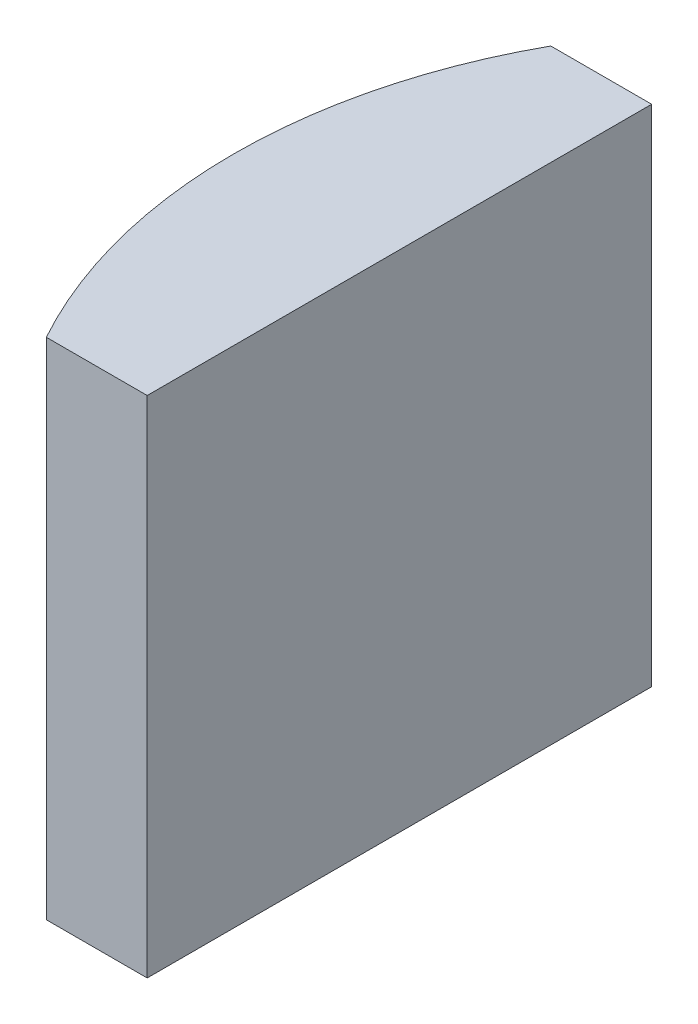
ISO-10303-21;
HEADER;
FILE_DESCRIPTION(('STEP AP214'),'2;1');
FILE_NAME('part.step','',(''),(''),'','','');
FILE_SCHEMA(('AUTOMOTIVE_DESIGN { 1 0 10303 214 1 1 1 1 }'));
ENDSEC;
DATA;
#1=APPLICATION_CONTEXT('core data for automotive mechanical design processes');
#2=APPLICATION_PROTOCOL_DEFINITION('international standard','automotive_design',2000,#1);
#3=PRODUCT_CONTEXT('',#1,'mechanical');
#4=PRODUCT('Part','Part','',(#3));
#5=PRODUCT_RELATED_PRODUCT_CATEGORY('part','',(#4));
#6=PRODUCT_DEFINITION_FORMATION('','',#4);
#7=PRODUCT_DEFINITION_CONTEXT('part definition',#1,'design');
#8=PRODUCT_DEFINITION('design','',#6,#7);
#9=PRODUCT_DEFINITION_SHAPE('','',#8);
#10=(LENGTH_UNIT() NAMED_UNIT(*) SI_UNIT(.MILLI.,.METRE.));
#11=(NAMED_UNIT(*) PLANE_ANGLE_UNIT() SI_UNIT($,.RADIAN.));
#12=(NAMED_UNIT(*) SI_UNIT($,.STERADIAN.) SOLID_ANGLE_UNIT());
#13=UNCERTAINTY_MEASURE_WITH_UNIT(LENGTH_MEASURE(1.E-05),#10,'distance_accuracy_value','');
#14=(GEOMETRIC_REPRESENTATION_CONTEXT(3) GLOBAL_UNCERTAINTY_ASSIGNED_CONTEXT((#13)) GLOBAL_UNIT_ASSIGNED_CONTEXT((#10,
#11,#12)) REPRESENTATION_CONTEXT('',''));
#15=CARTESIAN_POINT('',(0.,0.,0.));
#16=DIRECTION('',(0.,0.,1.));
#17=DIRECTION('',(1.,0.,0.));
#18=AXIS2_PLACEMENT_3D('',#15,#16,#17);
#19=CARTESIAN_POINT('',(4.35520433485127,10.,0.));
#20=DIRECTION('',(0.,-1.,0.));
#21=DIRECTION('',(0.,0.,-1.));
#22=AXIS2_PLACEMENT_3D('',#19,#20,#21);
#23=CYLINDRICAL_SURFACE('',#22,10.33);
#24=CARTESIAN_POINT('',(4.35520433485127,0.,0.));
#25=DIRECTION('',(0.,1.,0.));
#26=DIRECTION('',(0.,0.,1.));
#27=AXIS2_PLACEMENT_3D('',#24,#25,#26);
#28=CIRCLE('',#27,10.33);
#29=CARTESIAN_POINT('',(-4.68409320422776,0.,-5.));
#30=VERTEX_POINT('',#29);
#31=CARTESIAN_POINT('',(-4.68409320422775,0.,5.));
#32=VERTEX_POINT('',#31);
#33=EDGE_CURVE('E100',#30,#32,#28,.T.);
#34=ORIENTED_EDGE('',*,*,#33,.T.);
#35=DIRECTION('',(0.,-1.,0.));
#36=VECTOR('',#35,1.);
#37=CARTESIAN_POINT('',(-4.68409320422775,10.,5.));
#38=LINE('',#37,#36);
#39=CARTESIAN_POINT('',(-4.68409320422775,10.,5.));
#40=VERTEX_POINT('',#39);
#41=EDGE_CURVE('E11',#40,#32,#38,.T.);
#42=ORIENTED_EDGE('',*,*,#41,.F.);
#43=CARTESIAN_POINT('',(4.35520433485127,10.,0.));
#44=DIRECTION('',(0.,1.,0.));
#45=DIRECTION('',(0.,0.,1.));
#46=AXIS2_PLACEMENT_3D('',#43,#44,#45);
#47=CIRCLE('',#46,10.33);
#48=CARTESIAN_POINT('',(-4.68409320422776,10.,-5.));
#49=VERTEX_POINT('',#48);
#50=EDGE_CURVE('E88',#49,#40,#47,.T.);
#51=ORIENTED_EDGE('',*,*,#50,.F.);
#52=DIRECTION('',(0.,-1.,0.));
#53=VECTOR('',#52,1.);
#54=CARTESIAN_POINT('',(-4.68409320422776,10.,-5.));
#55=LINE('',#54,#53);
#56=EDGE_CURVE('E96',#49,#30,#55,.T.);
#57=ORIENTED_EDGE('',*,*,#56,.T.);
#58=EDGE_LOOP('',(#34,#42,#51,#57));
#59=FACE_BOUND('',#58,.T.);
#60=ADVANCED_FACE('F37',(#59),#23,.T.);
#61=CARTESIAN_POINT('',(-4.68409320422775,10.,5.));
#62=DIRECTION('',(0.,0.,-1.));
#63=DIRECTION('',(-1.,0.,0.));
#64=AXIS2_PLACEMENT_3D('',#61,#62,#63);
#65=PLANE('',#64);
#66=DIRECTION('',(1.,0.,0.));
#67=VECTOR('',#66,1.);
#68=CARTESIAN_POINT('',(-4.68409320422775,0.,5.));
#69=LINE('',#68,#67);
#70=CARTESIAN_POINT('',(-2.68479566514874,0.,5.));
#71=VERTEX_POINT('',#70);
#72=EDGE_CURVE('E92',#32,#71,#69,.T.);
#73=ORIENTED_EDGE('',*,*,#72,.T.);
#74=DIRECTION('',(0.,-1.,0.));
#75=VECTOR('',#74,1.);
#76=CARTESIAN_POINT('',(-2.68479566514874,10.,5.));
#77=LINE('',#76,#75);
#78=CARTESIAN_POINT('',(-2.68479566514874,10.,5.));
#79=VERTEX_POINT('',#78);
#80=EDGE_CURVE('E45',#79,#71,#77,.T.);
#81=ORIENTED_EDGE('',*,*,#80,.F.);
#82=DIRECTION('',(1.,0.,0.));
#83=VECTOR('',#82,1.);
#84=CARTESIAN_POINT('',(-4.68409320422775,10.,5.));
#85=LINE('',#84,#83);
#86=EDGE_CURVE('E83',#40,#79,#85,.T.);
#87=ORIENTED_EDGE('',*,*,#86,.F.);
#88=ORIENTED_EDGE('',*,*,#41,.T.);
#89=EDGE_LOOP('',(#73,#81,#87,#88));
#90=FACE_BOUND('',#89,.T.);
#91=ADVANCED_FACE('F91',(#90),#65,.F.);
#92=CARTESIAN_POINT('',(-2.68479566514874,10.,-5.));
#93=DIRECTION('',(-1.,0.,0.));
#94=DIRECTION('',(0.,0.,1.));
#95=AXIS2_PLACEMENT_3D('',#92,#93,#94);
#96=PLANE('',#95);
#97=DIRECTION('',(0.,0.,-1.));
#98=VECTOR('',#97,1.);
#99=CARTESIAN_POINT('',(-2.68479566514874,0.,-5.));
#100=LINE('',#99,#98);
#101=CARTESIAN_POINT('',(-2.68479566514874,0.,-5.));
#102=VERTEX_POINT('',#101);
#103=EDGE_CURVE('E70',#71,#102,#100,.T.);
#104=ORIENTED_EDGE('',*,*,#103,.T.);
#105=DIRECTION('',(0.,-1.,0.));
#106=VECTOR('',#105,1.);
#107=CARTESIAN_POINT('',(-2.68479566514874,10.,-5.));
#108=LINE('',#107,#106);
#109=CARTESIAN_POINT('',(-2.68479566514874,10.,-5.));
#110=VERTEX_POINT('',#109);
#111=EDGE_CURVE('E93',#110,#102,#108,.T.);
#112=ORIENTED_EDGE('',*,*,#111,.F.);
#113=DIRECTION('',(0.,0.,-1.));
#114=VECTOR('',#113,1.);
#115=CARTESIAN_POINT('',(-2.68479566514874,10.,-5.));
#116=LINE('',#115,#114);
#117=EDGE_CURVE('E86',#79,#110,#116,.T.);
#118=ORIENTED_EDGE('',*,*,#117,.F.);
#119=ORIENTED_EDGE('',*,*,#80,.T.);
#120=EDGE_LOOP('',(#104,#112,#118,#119));
#121=FACE_BOUND('',#120,.T.);
#122=ADVANCED_FACE('F94',(#121),#96,.F.);
#123=CARTESIAN_POINT('',(-4.68409320422776,10.,-5.));
#124=DIRECTION('',(0.,0.,1.));
#125=DIRECTION('',(1.,0.,0.));
#126=AXIS2_PLACEMENT_3D('',#123,#124,#125);
#127=PLANE('',#126);
#128=DIRECTION('',(-1.,0.,0.));
#129=VECTOR('',#128,1.);
#130=CARTESIAN_POINT('',(-4.68409320422776,0.,-5.));
#131=LINE('',#130,#129);
#132=EDGE_CURVE('E76',#102,#30,#131,.T.);
#133=ORIENTED_EDGE('',*,*,#132,.T.);
#134=ORIENTED_EDGE('',*,*,#56,.F.);
#135=DIRECTION('',(-1.,0.,0.));
#136=VECTOR('',#135,1.);
#137=CARTESIAN_POINT('',(-4.68409320422776,10.,-5.));
#138=LINE('',#137,#136);
#139=EDGE_CURVE('E53',#110,#49,#138,.T.);
#140=ORIENTED_EDGE('',*,*,#139,.F.);
#141=ORIENTED_EDGE('',*,*,#111,.T.);
#142=EDGE_LOOP('',(#133,#134,#140,#141));
#143=FACE_BOUND('',#142,.T.);
#144=ADVANCED_FACE('F107',(#143),#127,.F.);
#145=CARTESIAN_POINT('',(4.35520433485127,10.,0.));
#146=DIRECTION('',(0.,1.,0.));
#147=DIRECTION('',(0.,0.,1.));
#148=AXIS2_PLACEMENT_3D('',#145,#146,#147);
#149=PLANE('',#148);
#150=ORIENTED_EDGE('',*,*,#50,.T.);
#151=ORIENTED_EDGE('',*,*,#86,.T.);
#152=ORIENTED_EDGE('',*,*,#117,.T.);
#153=ORIENTED_EDGE('',*,*,#139,.T.);
#154=EDGE_LOOP('',(#150,#151,#152,#153));
#155=FACE_BOUND('',#154,.T.);
#156=ADVANCED_FACE('F84',(#155),#149,.T.);
#157=CARTESIAN_POINT('',(4.35520433485127,0.,0.));
#158=DIRECTION('',(0.,1.,0.));
#159=DIRECTION('',(0.,0.,1.));
#160=AXIS2_PLACEMENT_3D('',#157,#158,#159);
#161=PLANE('',#160);
#162=ORIENTED_EDGE('',*,*,#33,.F.);
#163=ORIENTED_EDGE('',*,*,#132,.F.);
#164=ORIENTED_EDGE('',*,*,#103,.F.);
#165=ORIENTED_EDGE('',*,*,#72,.F.);
#166=EDGE_LOOP('',(#162,#163,#164,#165));
#167=FACE_BOUND('',#166,.T.);
#168=ADVANCED_FACE('F110',(#167),#161,.F.);
#169=CLOSED_SHELL('',(#60,#91,#122,#144,#156,#168));
#170=MANIFOLD_SOLID_BREP('B2',#169);
#171=ADVANCED_BREP_SHAPE_REPRESENTATION('',(#18,#170),#14);
#172=SHAPE_DEFINITION_REPRESENTATION(#9,#171);
ENDSEC;
END-ISO-10303-21;
